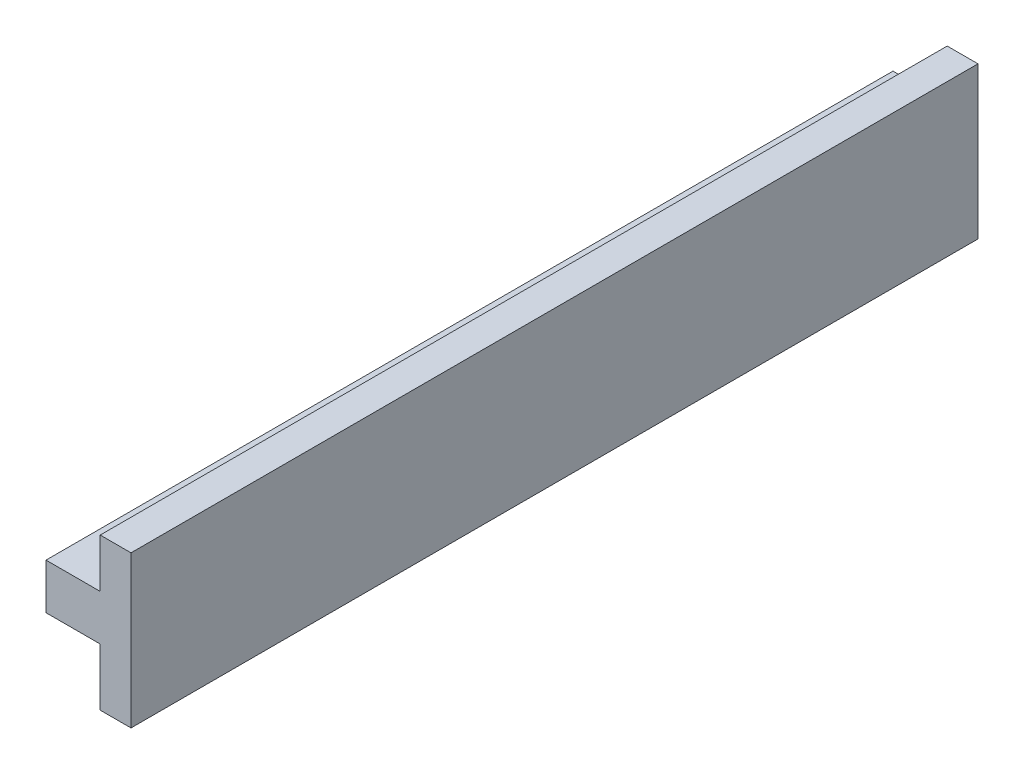
ISO-10303-21;
HEADER;
FILE_DESCRIPTION(('STEP AP214'),'2;1');
FILE_NAME('part.step','',(''),(''),'','','');
FILE_SCHEMA(('AUTOMOTIVE_DESIGN { 1 0 10303 214 1 1 1 1 }'));
ENDSEC;
DATA;
#1=APPLICATION_CONTEXT('core data for automotive mechanical design processes');
#2=APPLICATION_PROTOCOL_DEFINITION('international standard','automotive_design',2000,#1);
#3=PRODUCT_CONTEXT('',#1,'mechanical');
#4=PRODUCT('Part','Part','',(#3));
#5=PRODUCT_RELATED_PRODUCT_CATEGORY('part','',(#4));
#6=PRODUCT_DEFINITION_FORMATION('','',#4);
#7=PRODUCT_DEFINITION_CONTEXT('part definition',#1,'design');
#8=PRODUCT_DEFINITION('design','',#6,#7);
#9=PRODUCT_DEFINITION_SHAPE('','',#8);
#10=(LENGTH_UNIT() NAMED_UNIT(*) SI_UNIT(.MILLI.,.METRE.));
#11=(NAMED_UNIT(*) PLANE_ANGLE_UNIT() SI_UNIT($,.RADIAN.));
#12=(NAMED_UNIT(*) SI_UNIT($,.STERADIAN.) SOLID_ANGLE_UNIT());
#13=UNCERTAINTY_MEASURE_WITH_UNIT(LENGTH_MEASURE(1.E-05),#10,'distance_accuracy_value','');
#14=(GEOMETRIC_REPRESENTATION_CONTEXT(3) GLOBAL_UNCERTAINTY_ASSIGNED_CONTEXT((#13)) GLOBAL_UNIT_ASSIGNED_CONTEXT((#10,
#11,#12)) REPRESENTATION_CONTEXT('',''));
#15=CARTESIAN_POINT('',(0.,0.,0.));
#16=DIRECTION('',(0.,0.,1.));
#17=DIRECTION('',(1.,0.,0.));
#18=AXIS2_PLACEMENT_3D('',#15,#16,#17);
#19=CARTESIAN_POINT('',(85.9614087188153,36.3519572143948,-172.673777658695));
#20=DIRECTION('',(-1.,0.,0.));
#21=DIRECTION('',(0.,0.,1.));
#22=AXIS2_PLACEMENT_3D('',#19,#20,#21);
#23=PLANE('',#22);
#24=DIRECTION('',(0.,-1.,0.));
#25=VECTOR('',#24,1.);
#26=CARTESIAN_POINT('',(85.9614087188153,36.3519572143948,-35.1737776586952));
#27=LINE('',#26,#25);
#28=CARTESIAN_POINT('',(85.9614087188153,43.7519572143948,-35.1737776586952));
#29=VERTEX_POINT('',#28);
#30=CARTESIAN_POINT('',(85.9614087188153,36.3519572143948,-35.1737776586952));
#31=VERTEX_POINT('',#30);
#32=EDGE_CURVE('E129',#29,#31,#27,.T.);
#33=ORIENTED_EDGE('',*,*,#32,.F.);
#34=DIRECTION('',(0.,0.,1.));
#35=VECTOR('',#34,1.);
#36=CARTESIAN_POINT('',(85.9614087188153,43.7519572143948,-172.673777658695));
#37=LINE('',#36,#35);
#38=CARTESIAN_POINT('',(85.9614087188153,43.7519572143948,-172.673777658695));
#39=VERTEX_POINT('',#38);
#40=EDGE_CURVE('E11',#39,#29,#37,.T.);
#41=ORIENTED_EDGE('',*,*,#40,.F.);
#42=DIRECTION('',(0.,-1.,0.));
#43=VECTOR('',#42,1.);
#44=CARTESIAN_POINT('',(85.9614087188153,36.3519572143948,-172.673777658695));
#45=LINE('',#44,#43);
#46=CARTESIAN_POINT('',(85.9614087188153,36.3519572143948,-172.673777658695));
#47=VERTEX_POINT('',#46);
#48=EDGE_CURVE('E149',#39,#47,#45,.T.);
#49=ORIENTED_EDGE('',*,*,#48,.T.);
#50=DIRECTION('',(0.,0.,1.));
#51=VECTOR('',#50,1.);
#52=CARTESIAN_POINT('',(85.9614087188153,36.3519572143948,-172.673777658695));
#53=LINE('',#52,#51);
#54=EDGE_CURVE('E35',#47,#31,#53,.T.);
#55=ORIENTED_EDGE('',*,*,#54,.T.);
#56=EDGE_LOOP('',(#33,#41,#49,#55));
#57=FACE_BOUND('',#56,.T.);
#58=ADVANCED_FACE('F32',(#57),#23,.T.);
#59=CARTESIAN_POINT('',(85.9614087188153,43.7519572143948,-172.673777658695));
#60=DIRECTION('',(0.,1.,0.));
#61=DIRECTION('',(0.,0.,1.));
#62=AXIS2_PLACEMENT_3D('',#59,#60,#61);
#63=PLANE('',#62);
#64=DIRECTION('',(-1.,0.,0.));
#65=VECTOR('',#64,1.);
#66=CARTESIAN_POINT('',(85.9614087188153,43.7519572143948,-35.1737776586952));
#67=LINE('',#66,#65);
#68=CARTESIAN_POINT('',(94.7614087188153,43.7519572143948,-35.1737776586952));
#69=VERTEX_POINT('',#68);
#70=EDGE_CURVE('E147',#69,#29,#67,.T.);
#71=ORIENTED_EDGE('',*,*,#70,.F.);
#72=DIRECTION('',(0.,0.,1.));
#73=VECTOR('',#72,1.);
#74=CARTESIAN_POINT('',(94.7614087188153,43.7519572143948,-172.673777658695));
#75=LINE('',#74,#73);
#76=CARTESIAN_POINT('',(94.7614087188153,43.7519572143948,-172.673777658695));
#77=VERTEX_POINT('',#76);
#78=EDGE_CURVE('E41',#77,#69,#75,.T.);
#79=ORIENTED_EDGE('',*,*,#78,.F.);
#80=DIRECTION('',(-1.,0.,0.));
#81=VECTOR('',#80,1.);
#82=CARTESIAN_POINT('',(85.9614087188153,43.7519572143948,-172.673777658695));
#83=LINE('',#82,#81);
#84=EDGE_CURVE('E119',#77,#39,#83,.T.);
#85=ORIENTED_EDGE('',*,*,#84,.T.);
#86=ORIENTED_EDGE('',*,*,#40,.T.);
#87=EDGE_LOOP('',(#71,#79,#85,#86));
#88=FACE_BOUND('',#87,.T.);
#89=ADVANCED_FACE('F161',(#88),#63,.T.);
#90=CARTESIAN_POINT('',(94.7614087188153,51.6762443010053,-172.673777658695));
#91=DIRECTION('',(-1.,0.,0.));
#92=DIRECTION('',(0.,0.,1.));
#93=AXIS2_PLACEMENT_3D('',#90,#91,#92);
#94=PLANE('',#93);
#95=DIRECTION('',(0.,-1.,0.));
#96=VECTOR('',#95,1.);
#97=CARTESIAN_POINT('',(94.7614087188153,51.6762443010053,-35.1737776586952));
#98=LINE('',#97,#96);
#99=CARTESIAN_POINT('',(94.7614087188153,51.6762443010053,-35.1737776586952));
#100=VERTEX_POINT('',#99);
#101=EDGE_CURVE('E106',#100,#69,#98,.T.);
#102=ORIENTED_EDGE('',*,*,#101,.F.);
#103=DIRECTION('',(0.,0.,1.));
#104=VECTOR('',#103,1.);
#105=CARTESIAN_POINT('',(94.7614087188153,51.6762443010053,-172.673777658695));
#106=LINE('',#105,#104);
#107=CARTESIAN_POINT('',(94.7614087188153,51.6762443010053,-172.673777658695));
#108=VERTEX_POINT('',#107);
#109=EDGE_CURVE('E101',#108,#100,#106,.T.);
#110=ORIENTED_EDGE('',*,*,#109,.F.);
#111=DIRECTION('',(0.,-1.,0.));
#112=VECTOR('',#111,1.);
#113=CARTESIAN_POINT('',(94.7614087188153,51.6762443010053,-172.673777658695));
#114=LINE('',#113,#112);
#115=EDGE_CURVE('E104',#108,#77,#114,.T.);
#116=ORIENTED_EDGE('',*,*,#115,.T.);
#117=ORIENTED_EDGE('',*,*,#78,.T.);
#118=EDGE_LOOP('',(#102,#110,#116,#117));
#119=FACE_BOUND('',#118,.T.);
#120=ADVANCED_FACE('F103',(#119),#94,.T.);
#121=CARTESIAN_POINT('',(99.7614087188153,51.6762443010053,-172.673777658695));
#122=DIRECTION('',(0.,1.,0.));
#123=DIRECTION('',(0.,0.,1.));
#124=AXIS2_PLACEMENT_3D('',#121,#122,#123);
#125=PLANE('',#124);
#126=DIRECTION('',(-1.,0.,0.));
#127=VECTOR('',#126,1.);
#128=CARTESIAN_POINT('',(99.7614087188153,51.6762443010053,-35.1737776586952));
#129=LINE('',#128,#127);
#130=CARTESIAN_POINT('',(99.7614087188153,51.6762443010053,-35.1737776586952));
#131=VERTEX_POINT('',#130);
#132=EDGE_CURVE('E144',#131,#100,#129,.T.);
#133=ORIENTED_EDGE('',*,*,#132,.F.);
#134=DIRECTION('',(0.,0.,1.));
#135=VECTOR('',#134,1.);
#136=CARTESIAN_POINT('',(99.7614087188153,51.6762443010053,-172.673777658695));
#137=LINE('',#136,#135);
#138=CARTESIAN_POINT('',(99.7614087188153,51.6762443010053,-172.673777658695));
#139=VERTEX_POINT('',#138);
#140=EDGE_CURVE('E111',#139,#131,#137,.T.);
#141=ORIENTED_EDGE('',*,*,#140,.F.);
#142=DIRECTION('',(-1.,0.,0.));
#143=VECTOR('',#142,1.);
#144=CARTESIAN_POINT('',(99.7614087188153,51.6762443010053,-172.673777658695));
#145=LINE('',#144,#143);
#146=EDGE_CURVE('E117',#139,#108,#145,.T.);
#147=ORIENTED_EDGE('',*,*,#146,.T.);
#148=ORIENTED_EDGE('',*,*,#109,.T.);
#149=EDGE_LOOP('',(#133,#141,#147,#148));
#150=FACE_BOUND('',#149,.T.);
#151=ADVANCED_FACE('F121',(#150),#125,.T.);
#152=CARTESIAN_POINT('',(99.7614087188153,51.6762443010053,-172.673777658695));
#153=DIRECTION('',(1.,0.,0.));
#154=DIRECTION('',(0.,0.,-1.));
#155=AXIS2_PLACEMENT_3D('',#152,#153,#154);
#156=PLANE('',#155);
#157=DIRECTION('',(0.,1.,0.));
#158=VECTOR('',#157,1.);
#159=CARTESIAN_POINT('',(99.7614087188153,51.6762443010053,-35.1737776586952));
#160=LINE('',#159,#158);
#161=CARTESIAN_POINT('',(99.7614087188153,27.0519572143948,-35.1737776586952));
#162=VERTEX_POINT('',#161);
#163=EDGE_CURVE('E141',#162,#131,#160,.T.);
#164=ORIENTED_EDGE('',*,*,#163,.F.);
#165=DIRECTION('',(0.,0.,1.));
#166=VECTOR('',#165,1.);
#167=CARTESIAN_POINT('',(99.7614087188153,27.0519572143948,-172.673777658695));
#168=LINE('',#167,#166);
#169=CARTESIAN_POINT('',(99.7614087188153,27.0519572143948,-172.673777658695));
#170=VERTEX_POINT('',#169);
#171=EDGE_CURVE('E153',#170,#162,#168,.T.);
#172=ORIENTED_EDGE('',*,*,#171,.F.);
#173=DIRECTION('',(0.,1.,0.));
#174=VECTOR('',#173,1.);
#175=CARTESIAN_POINT('',(99.7614087188153,51.6762443010053,-172.673777658695));
#176=LINE('',#175,#174);
#177=EDGE_CURVE('E122',#170,#139,#176,.T.);
#178=ORIENTED_EDGE('',*,*,#177,.T.);
#179=ORIENTED_EDGE('',*,*,#140,.T.);
#180=EDGE_LOOP('',(#164,#172,#178,#179));
#181=FACE_BOUND('',#180,.T.);
#182=ADVANCED_FACE('F174',(#181),#156,.T.);
#183=CARTESIAN_POINT('',(99.7614087188153,27.0519572143948,-172.673777658695));
#184=DIRECTION('',(0.,-1.,0.));
#185=DIRECTION('',(0.,0.,-1.));
#186=AXIS2_PLACEMENT_3D('',#183,#184,#185);
#187=PLANE('',#186);
#188=DIRECTION('',(1.,0.,0.));
#189=VECTOR('',#188,1.);
#190=CARTESIAN_POINT('',(99.7614087188153,27.0519572143948,-35.1737776586952));
#191=LINE('',#190,#189);
#192=CARTESIAN_POINT('',(94.7614087188153,27.0519572143948,-35.1737776586952));
#193=VERTEX_POINT('',#192);
#194=EDGE_CURVE('E138',#193,#162,#191,.T.);
#195=ORIENTED_EDGE('',*,*,#194,.F.);
#196=DIRECTION('',(0.,0.,1.));
#197=VECTOR('',#196,1.);
#198=CARTESIAN_POINT('',(94.7614087188153,27.0519572143948,-172.673777658695));
#199=LINE('',#198,#197);
#200=CARTESIAN_POINT('',(94.7614087188153,27.0519572143948,-172.673777658695));
#201=VERTEX_POINT('',#200);
#202=EDGE_CURVE('E155',#201,#193,#199,.T.);
#203=ORIENTED_EDGE('',*,*,#202,.F.);
#204=DIRECTION('',(1.,0.,0.));
#205=VECTOR('',#204,1.);
#206=CARTESIAN_POINT('',(99.7614087188153,27.0519572143948,-172.673777658695));
#207=LINE('',#206,#205);
#208=EDGE_CURVE('E124',#201,#170,#207,.T.);
#209=ORIENTED_EDGE('',*,*,#208,.T.);
#210=ORIENTED_EDGE('',*,*,#171,.T.);
#211=EDGE_LOOP('',(#195,#203,#209,#210));
#212=FACE_BOUND('',#211,.T.);
#213=ADVANCED_FACE('F177',(#212),#187,.T.);
#214=CARTESIAN_POINT('',(94.7614087188153,27.0519572143948,-172.673777658695));
#215=DIRECTION('',(-1.,0.,0.));
#216=DIRECTION('',(0.,0.,1.));
#217=AXIS2_PLACEMENT_3D('',#214,#215,#216);
#218=PLANE('',#217);
#219=DIRECTION('',(0.,-1.,0.));
#220=VECTOR('',#219,1.);
#221=CARTESIAN_POINT('',(94.7614087188153,27.0519572143948,-35.1737776586952));
#222=LINE('',#221,#220);
#223=CARTESIAN_POINT('',(94.7614087188153,36.3519572143948,-35.1737776586952));
#224=VERTEX_POINT('',#223);
#225=EDGE_CURVE('E135',#224,#193,#222,.T.);
#226=ORIENTED_EDGE('',*,*,#225,.F.);
#227=DIRECTION('',(0.,0.,1.));
#228=VECTOR('',#227,1.);
#229=CARTESIAN_POINT('',(94.7614087188153,36.3519572143948,-172.673777658695));
#230=LINE('',#229,#228);
#231=CARTESIAN_POINT('',(94.7614087188153,36.3519572143948,-172.673777658695));
#232=VERTEX_POINT('',#231);
#233=EDGE_CURVE('E156',#232,#224,#230,.T.);
#234=ORIENTED_EDGE('',*,*,#233,.F.);
#235=DIRECTION('',(0.,-1.,0.));
#236=VECTOR('',#235,1.);
#237=CARTESIAN_POINT('',(94.7614087188153,27.0519572143948,-172.673777658695));
#238=LINE('',#237,#236);
#239=EDGE_CURVE('E252',#232,#201,#238,.T.);
#240=ORIENTED_EDGE('',*,*,#239,.T.);
#241=ORIENTED_EDGE('',*,*,#202,.T.);
#242=EDGE_LOOP('',(#226,#234,#240,#241));
#243=FACE_BOUND('',#242,.T.);
#244=ADVANCED_FACE('F181',(#243),#218,.T.);
#245=CARTESIAN_POINT('',(94.7614087188153,36.3519572143948,-172.673777658695));
#246=DIRECTION('',(0.,-1.,0.));
#247=DIRECTION('',(0.,0.,-1.));
#248=AXIS2_PLACEMENT_3D('',#245,#246,#247);
#249=PLANE('',#248);
#250=DIRECTION('',(1.,0.,0.));
#251=VECTOR('',#250,1.);
#252=CARTESIAN_POINT('',(94.7614087188153,36.3519572143948,-35.1737776586952));
#253=LINE('',#252,#251);
#254=EDGE_CURVE('E132',#31,#224,#253,.T.);
#255=ORIENTED_EDGE('',*,*,#254,.F.);
#256=ORIENTED_EDGE('',*,*,#54,.F.);
#257=DIRECTION('',(1.,0.,0.));
#258=VECTOR('',#257,1.);
#259=CARTESIAN_POINT('',(94.7614087188153,36.3519572143948,-172.673777658695));
#260=LINE('',#259,#258);
#261=EDGE_CURVE('E253',#47,#232,#260,.T.);
#262=ORIENTED_EDGE('',*,*,#261,.T.);
#263=ORIENTED_EDGE('',*,*,#233,.T.);
#264=EDGE_LOOP('',(#255,#256,#262,#263));
#265=FACE_BOUND('',#264,.T.);
#266=ADVANCED_FACE('F158',(#265),#249,.T.);
#267=CARTESIAN_POINT('',(0.,0.,-172.673777658695));
#268=DIRECTION('',(0.,0.,-1.));
#269=DIRECTION('',(-1.,0.,0.));
#270=AXIS2_PLACEMENT_3D('',#267,#268,#269);
#271=PLANE('',#270);
#272=ORIENTED_EDGE('',*,*,#48,.F.);
#273=ORIENTED_EDGE('',*,*,#84,.F.);
#274=ORIENTED_EDGE('',*,*,#115,.F.);
#275=ORIENTED_EDGE('',*,*,#146,.F.);
#276=ORIENTED_EDGE('',*,*,#177,.F.);
#277=ORIENTED_EDGE('',*,*,#208,.F.);
#278=ORIENTED_EDGE('',*,*,#239,.F.);
#279=ORIENTED_EDGE('',*,*,#261,.F.);
#280=EDGE_LOOP('',(#272,#273,#274,#275,#276,#277,#278,#279));
#281=FACE_BOUND('',#280,.T.);
#282=ADVANCED_FACE('F115',(#281),#271,.T.);
#283=CARTESIAN_POINT('',(0.,0.,-35.1737776586952));
#284=DIRECTION('',(0.,0.,-1.));
#285=DIRECTION('',(-1.,0.,0.));
#286=AXIS2_PLACEMENT_3D('',#283,#284,#285);
#287=PLANE('',#286);
#288=ORIENTED_EDGE('',*,*,#32,.T.);
#289=ORIENTED_EDGE('',*,*,#254,.T.);
#290=ORIENTED_EDGE('',*,*,#225,.T.);
#291=ORIENTED_EDGE('',*,*,#194,.T.);
#292=ORIENTED_EDGE('',*,*,#163,.T.);
#293=ORIENTED_EDGE('',*,*,#132,.T.);
#294=ORIENTED_EDGE('',*,*,#101,.T.);
#295=ORIENTED_EDGE('',*,*,#70,.T.);
#296=EDGE_LOOP('',(#288,#289,#290,#291,#292,#293,#294,#295));
#297=FACE_BOUND('',#296,.T.);
#298=ADVANCED_FACE('F160',(#297),#287,.F.);
#299=CLOSED_SHELL('',(#58,#89,#120,#151,#182,#213,#244,#266,#282,#298));
#300=MANIFOLD_SOLID_BREP('B2',#299);
#301=ADVANCED_BREP_SHAPE_REPRESENTATION('',(#18,#300),#14);
#302=SHAPE_DEFINITION_REPRESENTATION(#9,#301);
ENDSEC;
END-ISO-10303-21;
